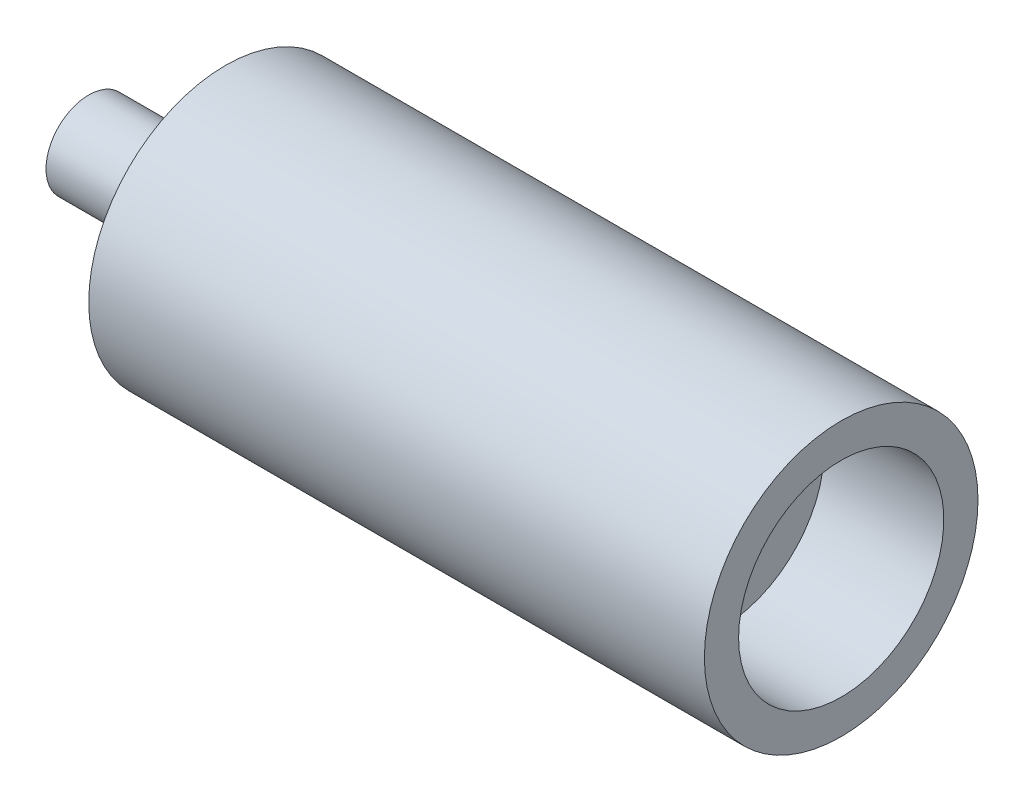
ISO-10303-21;
HEADER;
FILE_DESCRIPTION(('STEP AP214'),'2;1');
FILE_NAME('part.step','',(''),(''),'','','');
FILE_SCHEMA(('AUTOMOTIVE_DESIGN { 1 0 10303 214 1 1 1 1 }'));
ENDSEC;
DATA;
#1=APPLICATION_CONTEXT('core data for automotive mechanical design processes');
#2=APPLICATION_PROTOCOL_DEFINITION('international standard','automotive_design',2000,#1);
#3=PRODUCT_CONTEXT('',#1,'mechanical');
#4=PRODUCT('Part','Part','',(#3));
#5=PRODUCT_RELATED_PRODUCT_CATEGORY('part','',(#4));
#6=PRODUCT_DEFINITION_FORMATION('','',#4);
#7=PRODUCT_DEFINITION_CONTEXT('part definition',#1,'design');
#8=PRODUCT_DEFINITION('design','',#6,#7);
#9=PRODUCT_DEFINITION_SHAPE('','',#8);
#10=(LENGTH_UNIT() NAMED_UNIT(*) SI_UNIT(.MILLI.,.METRE.));
#11=(NAMED_UNIT(*) PLANE_ANGLE_UNIT() SI_UNIT($,.RADIAN.));
#12=(NAMED_UNIT(*) SI_UNIT($,.STERADIAN.) SOLID_ANGLE_UNIT());
#13=UNCERTAINTY_MEASURE_WITH_UNIT(LENGTH_MEASURE(1.E-05),#10,'distance_accuracy_value','');
#14=(GEOMETRIC_REPRESENTATION_CONTEXT(3) GLOBAL_UNCERTAINTY_ASSIGNED_CONTEXT((#13)) GLOBAL_UNIT_ASSIGNED_CONTEXT((#10,
#11,#12)) REPRESENTATION_CONTEXT('',''));
#15=CARTESIAN_POINT('',(0.,0.,0.));
#16=DIRECTION('',(0.,0.,1.));
#17=DIRECTION('',(1.,0.,0.));
#18=AXIS2_PLACEMENT_3D('',#15,#16,#17);
#19=CARTESIAN_POINT('',(0.,0.,0.));
#20=DIRECTION('',(1.,0.,0.));
#21=DIRECTION('',(0.,0.,-1.));
#22=AXIS2_PLACEMENT_3D('',#19,#20,#21);
#23=PLANE('',#22);
#24=CARTESIAN_POINT('',(0.,0.,0.));
#25=DIRECTION('',(-1.,0.,0.));
#26=DIRECTION('',(0.,0.,1.));
#27=AXIS2_PLACEMENT_3D('',#24,#25,#26);
#28=CIRCLE('',#27,12.5);
#29=CARTESIAN_POINT('',(0.,0.,12.5));
#30=VERTEX_POINT('',#29);
#31=EDGE_CURVE('E10',#30,#30,#28,.T.);
#32=ORIENTED_EDGE('',*,*,#31,.T.);
#33=EDGE_LOOP('',(#32));
#34=FACE_BOUND('',#33,.T.);
#35=ADVANCED_FACE('F39',(#34),#23,.F.);
#36=CARTESIAN_POINT('',(37.7600807716813,0.,0.));
#37=DIRECTION('',(-1.,0.,0.));
#38=DIRECTION('',(0.,0.,1.));
#39=AXIS2_PLACEMENT_3D('',#36,#37,#38);
#40=CYLINDRICAL_SURFACE('',#39,12.5);
#41=ORIENTED_EDGE('',*,*,#31,.F.);
#42=EDGE_LOOP('',(#41));
#43=FACE_BOUND('',#42,.T.);
#44=CARTESIAN_POINT('',(30.,0.,0.));
#45=DIRECTION('',(-1.,0.,0.));
#46=DIRECTION('',(0.,0.,1.));
#47=AXIS2_PLACEMENT_3D('',#44,#45,#46);
#48=CIRCLE('',#47,12.5);
#49=CARTESIAN_POINT('',(30.,0.,12.5));
#50=VERTEX_POINT('',#49);
#51=EDGE_CURVE('E45',#50,#50,#48,.T.);
#52=ORIENTED_EDGE('',*,*,#51,.T.);
#53=EDGE_LOOP('',(#52));
#54=FACE_BOUND('',#53,.T.);
#55=ADVANCED_FACE('F92',(#43,#54),#40,.T.);
#56=CARTESIAN_POINT('',(30.,12.5,0.));
#57=DIRECTION('',(1.,0.,0.));
#58=DIRECTION('',(0.,0.,-1.));
#59=AXIS2_PLACEMENT_3D('',#56,#57,#58);
#60=PLANE('',#59);
#61=ORIENTED_EDGE('',*,*,#51,.F.);
#62=EDGE_LOOP('',(#61));
#63=FACE_BOUND('',#62,.T.);
#64=CARTESIAN_POINT('',(30.,0.,0.));
#65=DIRECTION('',(-1.,0.,0.));
#66=DIRECTION('',(0.,0.,1.));
#67=AXIS2_PLACEMENT_3D('',#64,#65,#66);
#68=CIRCLE('',#67,20.);
#69=CARTESIAN_POINT('',(30.,0.,20.));
#70=VERTEX_POINT('',#69);
#71=EDGE_CURVE('E49',#70,#70,#68,.T.);
#72=ORIENTED_EDGE('',*,*,#71,.T.);
#73=EDGE_LOOP('',(#72));
#74=FACE_BOUND('',#73,.T.);
#75=ADVANCED_FACE('F96',(#63,#74),#60,.F.);
#76=CARTESIAN_POINT('',(33.,0.,0.));
#77=DIRECTION('',(1.,0.,0.));
#78=DIRECTION('',(0.,0.,-1.));
#79=AXIS2_PLACEMENT_3D('',#76,#77,#78);
#80=CONICAL_SURFACE('',#79,25.,1.03037682652431);
#81=ORIENTED_EDGE('',*,*,#71,.F.);
#82=EDGE_LOOP('',(#81));
#83=FACE_BOUND('',#82,.T.);
#84=CARTESIAN_POINT('',(33.,0.,0.));
#85=DIRECTION('',(-1.,0.,0.));
#86=DIRECTION('',(0.,0.,1.));
#87=AXIS2_PLACEMENT_3D('',#84,#85,#86);
#88=CIRCLE('',#87,25.);
#89=CARTESIAN_POINT('',(33.,0.,25.));
#90=VERTEX_POINT('',#89);
#91=EDGE_CURVE('E53',#90,#90,#88,.T.);
#92=ORIENTED_EDGE('',*,*,#91,.T.);
#93=EDGE_LOOP('',(#92));
#94=FACE_BOUND('',#93,.T.);
#95=ADVANCED_FACE('F101',(#83,#94),#80,.T.);
#96=CARTESIAN_POINT('',(37.7600807716813,0.,0.));
#97=DIRECTION('',(-1.,0.,0.));
#98=DIRECTION('',(0.,0.,1.));
#99=AXIS2_PLACEMENT_3D('',#96,#97,#98);
#100=CYLINDRICAL_SURFACE('',#99,25.);
#101=ORIENTED_EDGE('',*,*,#91,.F.);
#102=EDGE_LOOP('',(#101));
#103=FACE_BOUND('',#102,.T.);
#104=CARTESIAN_POINT('',(35.,0.,0.));
#105=DIRECTION('',(-1.,0.,0.));
#106=DIRECTION('',(0.,0.,1.));
#107=AXIS2_PLACEMENT_3D('',#104,#105,#106);
#108=CIRCLE('',#107,25.);
#109=CARTESIAN_POINT('',(35.,0.,25.));
#110=VERTEX_POINT('',#109);
#111=EDGE_CURVE('E58',#110,#110,#108,.T.);
#112=ORIENTED_EDGE('',*,*,#111,.T.);
#113=EDGE_LOOP('',(#112));
#114=FACE_BOUND('',#113,.T.);
#115=ADVANCED_FACE('F107',(#103,#114),#100,.T.);
#116=CARTESIAN_POINT('',(35.,25.,0.));
#117=DIRECTION('',(1.,0.,0.));
#118=DIRECTION('',(0.,0.,-1.));
#119=AXIS2_PLACEMENT_3D('',#116,#117,#118);
#120=PLANE('',#119);
#121=ORIENTED_EDGE('',*,*,#111,.F.);
#122=EDGE_LOOP('',(#121));
#123=FACE_BOUND('',#122,.T.);
#124=CARTESIAN_POINT('',(35.,0.,0.));
#125=DIRECTION('',(-1.,0.,0.));
#126=DIRECTION('',(0.,0.,1.));
#127=AXIS2_PLACEMENT_3D('',#124,#125,#126);
#128=CIRCLE('',#127,32.5);
#129=CARTESIAN_POINT('',(35.,0.,32.5));
#130=VERTEX_POINT('',#129);
#131=EDGE_CURVE('E61',#130,#130,#128,.T.);
#132=ORIENTED_EDGE('',*,*,#131,.T.);
#133=EDGE_LOOP('',(#132));
#134=FACE_BOUND('',#133,.T.);
#135=ADVANCED_FACE('F111',(#123,#134),#120,.F.);
#136=CARTESIAN_POINT('',(37.7600807716813,0.,0.));
#137=DIRECTION('',(-1.,0.,0.));
#138=DIRECTION('',(0.,0.,1.));
#139=AXIS2_PLACEMENT_3D('',#136,#137,#138);
#140=CYLINDRICAL_SURFACE('',#139,32.5);
#141=ORIENTED_EDGE('',*,*,#131,.F.);
#142=EDGE_LOOP('',(#141));
#143=FACE_BOUND('',#142,.T.);
#144=CARTESIAN_POINT('',(40.,0.,0.));
#145=DIRECTION('',(-1.,0.,0.));
#146=DIRECTION('',(0.,0.,1.));
#147=AXIS2_PLACEMENT_3D('',#144,#145,#146);
#148=CIRCLE('',#147,32.5);
#149=CARTESIAN_POINT('',(40.,0.,32.5));
#150=VERTEX_POINT('',#149);
#151=EDGE_CURVE('E64',#150,#150,#148,.T.);
#152=ORIENTED_EDGE('',*,*,#151,.T.);
#153=EDGE_LOOP('',(#152));
#154=FACE_BOUND('',#153,.T.);
#155=ADVANCED_FACE('F115',(#143,#154),#140,.T.);
#156=CARTESIAN_POINT('',(40.,32.5,0.));
#157=DIRECTION('',(1.,0.,0.));
#158=DIRECTION('',(0.,0.,-1.));
#159=AXIS2_PLACEMENT_3D('',#156,#157,#158);
#160=PLANE('',#159);
#161=ORIENTED_EDGE('',*,*,#151,.F.);
#162=EDGE_LOOP('',(#161));
#163=FACE_BOUND('',#162,.T.);
#164=CARTESIAN_POINT('',(40.,0.,0.));
#165=DIRECTION('',(-1.,0.,0.));
#166=DIRECTION('',(0.,0.,1.));
#167=AXIS2_PLACEMENT_3D('',#164,#165,#166);
#168=CIRCLE('',#167,40.);
#169=CARTESIAN_POINT('',(40.,0.,40.));
#170=VERTEX_POINT('',#169);
#171=EDGE_CURVE('E67',#170,#170,#168,.T.);
#172=ORIENTED_EDGE('',*,*,#171,.T.);
#173=EDGE_LOOP('',(#172));
#174=FACE_BOUND('',#173,.T.);
#175=ADVANCED_FACE('F119',(#163,#174),#160,.F.);
#176=CARTESIAN_POINT('',(37.7600807716813,0.,0.));
#177=DIRECTION('',(-1.,0.,0.));
#178=DIRECTION('',(0.,0.,1.));
#179=AXIS2_PLACEMENT_3D('',#176,#177,#178);
#180=CYLINDRICAL_SURFACE('',#179,40.);
#181=ORIENTED_EDGE('',*,*,#171,.F.);
#182=EDGE_LOOP('',(#181));
#183=FACE_BOUND('',#182,.T.);
#184=CARTESIAN_POINT('',(220.,0.,0.));
#185=DIRECTION('',(-1.,0.,0.));
#186=DIRECTION('',(0.,0.,1.));
#187=AXIS2_PLACEMENT_3D('',#184,#185,#186);
#188=CIRCLE('',#187,40.);
#189=CARTESIAN_POINT('',(220.,0.,40.));
#190=VERTEX_POINT('',#189);
#191=EDGE_CURVE('E70',#190,#190,#188,.T.);
#192=ORIENTED_EDGE('',*,*,#191,.T.);
#193=EDGE_LOOP('',(#192));
#194=FACE_BOUND('',#193,.T.);
#195=ADVANCED_FACE('F123',(#183,#194),#180,.T.);
#196=CARTESIAN_POINT('',(220.,40.,0.));
#197=DIRECTION('',(-1.,0.,0.));
#198=DIRECTION('',(0.,0.,1.));
#199=AXIS2_PLACEMENT_3D('',#196,#197,#198);
#200=PLANE('',#199);
#201=ORIENTED_EDGE('',*,*,#191,.F.);
#202=EDGE_LOOP('',(#201));
#203=FACE_BOUND('',#202,.T.);
#204=CARTESIAN_POINT('',(220.,0.,0.));
#205=DIRECTION('',(-1.,0.,0.));
#206=DIRECTION('',(0.,0.,1.));
#207=AXIS2_PLACEMENT_3D('',#204,#205,#206);
#208=CIRCLE('',#207,30.);
#209=CARTESIAN_POINT('',(220.,0.,30.));
#210=VERTEX_POINT('',#209);
#211=EDGE_CURVE('E73',#210,#210,#208,.T.);
#212=ORIENTED_EDGE('',*,*,#211,.T.);
#213=EDGE_LOOP('',(#212));
#214=FACE_BOUND('',#213,.T.);
#215=ADVANCED_FACE('F88',(#203,#214),#200,.F.);
#216=CARTESIAN_POINT('',(37.7600807716813,0.,0.));
#217=DIRECTION('',(-1.,0.,0.));
#218=DIRECTION('',(0.,0.,1.));
#219=AXIS2_PLACEMENT_3D('',#216,#217,#218);
#220=CYLINDRICAL_SURFACE('',#219,30.);
#221=ORIENTED_EDGE('',*,*,#211,.F.);
#222=EDGE_LOOP('',(#221));
#223=FACE_BOUND('',#222,.T.);
#224=CARTESIAN_POINT('',(185.,0.,0.));
#225=DIRECTION('',(-1.,0.,0.));
#226=DIRECTION('',(0.,0.,1.));
#227=AXIS2_PLACEMENT_3D('',#224,#225,#226);
#228=CIRCLE('',#227,30.);
#229=CARTESIAN_POINT('',(185.,0.,30.));
#230=VERTEX_POINT('',#229);
#231=EDGE_CURVE('E76',#230,#230,#228,.T.);
#232=ORIENTED_EDGE('',*,*,#231,.T.);
#233=EDGE_LOOP('',(#232));
#234=FACE_BOUND('',#233,.T.);
#235=ADVANCED_FACE('F80',(#223,#234),#220,.F.);
#236=CARTESIAN_POINT('',(185.,30.,0.));
#237=DIRECTION('',(-1.,0.,0.));
#238=DIRECTION('',(0.,0.,1.));
#239=AXIS2_PLACEMENT_3D('',#236,#237,#238);
#240=PLANE('',#239);
#241=ORIENTED_EDGE('',*,*,#231,.F.);
#242=EDGE_LOOP('',(#241));
#243=FACE_BOUND('',#242,.T.);
#244=ADVANCED_FACE('F82',(#243),#240,.F.);
#245=CLOSED_SHELL('',(#35,#55,#75,#95,#115,#135,#155,#175,#195,#215,#235,#244));
#246=MANIFOLD_SOLID_BREP('B2',#245);
#247=ADVANCED_BREP_SHAPE_REPRESENTATION('',(#18,#246),#14);
#248=SHAPE_DEFINITION_REPRESENTATION(#9,#247);
ENDSEC;
END-ISO-10303-21;
